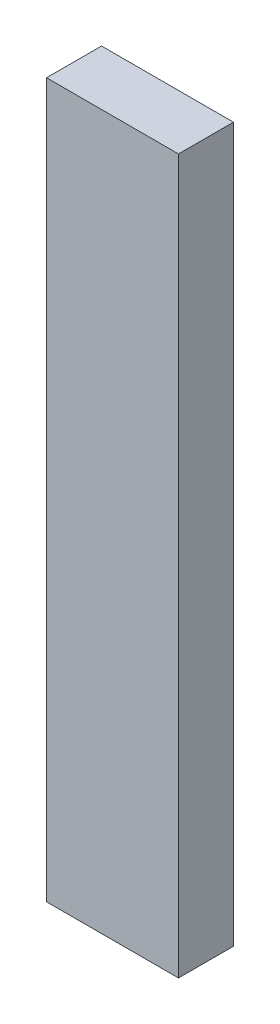
ISO-10303-21;
HEADER;
FILE_DESCRIPTION(('STEP AP214'),'2;1');
FILE_NAME('part.step','',(''),(''),'','','');
FILE_SCHEMA(('AUTOMOTIVE_DESIGN { 1 0 10303 214 1 1 1 1 }'));
ENDSEC;
DATA;
#1=APPLICATION_CONTEXT('core data for automotive mechanical design processes');
#2=APPLICATION_PROTOCOL_DEFINITION('international standard','automotive_design',2000,#1);
#3=PRODUCT_CONTEXT('',#1,'mechanical');
#4=PRODUCT('Part','Part','',(#3));
#5=PRODUCT_RELATED_PRODUCT_CATEGORY('part','',(#4));
#6=PRODUCT_DEFINITION_FORMATION('','',#4);
#7=PRODUCT_DEFINITION_CONTEXT('part definition',#1,'design');
#8=PRODUCT_DEFINITION('design','',#6,#7);
#9=PRODUCT_DEFINITION_SHAPE('','',#8);
#10=(LENGTH_UNIT() NAMED_UNIT(*) SI_UNIT(.MILLI.,.METRE.));
#11=(NAMED_UNIT(*) PLANE_ANGLE_UNIT() SI_UNIT($,.RADIAN.));
#12=(NAMED_UNIT(*) SI_UNIT($,.STERADIAN.) SOLID_ANGLE_UNIT());
#13=UNCERTAINTY_MEASURE_WITH_UNIT(LENGTH_MEASURE(1.E-05),#10,'distance_accuracy_value','');
#14=(GEOMETRIC_REPRESENTATION_CONTEXT(3) GLOBAL_UNCERTAINTY_ASSIGNED_CONTEXT((#13)) GLOBAL_UNIT_ASSIGNED_CONTEXT((#10,
#11,#12)) REPRESENTATION_CONTEXT('',''));
#15=CARTESIAN_POINT('',(0.,0.,0.));
#16=DIRECTION('',(0.,0.,1.));
#17=DIRECTION('',(1.,0.,0.));
#18=AXIS2_PLACEMENT_3D('',#15,#16,#17);
#19=CARTESIAN_POINT('',(-27.7297166911199,15.,0.));
#20=DIRECTION('',(-1.,0.,0.));
#21=DIRECTION('',(0.,0.,1.));
#22=AXIS2_PLACEMENT_3D('',#19,#20,#21);
#23=PLANE('',#22);
#24=DIRECTION('',(0.,0.,1.));
#25=VECTOR('',#24,1.);
#26=CARTESIAN_POINT('',(-27.7297166911199,-49.9016400553733,-75.3115837217811));
#27=LINE('',#26,#25);
#28=CARTESIAN_POINT('',(-27.7297166911199,-49.9016400553733,-75.3115837217811));
#29=VERTEX_POINT('',#28);
#30=CARTESIAN_POINT('',(-27.7297166911199,-49.9016400553734,-70.3115837217811));
#31=VERTEX_POINT('',#30);
#32=EDGE_CURVE('E49',#29,#31,#27,.T.);
#33=ORIENTED_EDGE('',*,*,#32,.F.);
#34=DIRECTION('',(0.,-1.,0.));
#35=VECTOR('',#34,1.);
#36=CARTESIAN_POINT('',(-27.7297166911199,15.,-75.3115837217811));
#37=LINE('',#36,#35);
#38=CARTESIAN_POINT('',(-27.7297166911199,15.,-75.3115837217811));
#39=VERTEX_POINT('',#38);
#40=EDGE_CURVE('E11',#39,#29,#37,.T.);
#41=ORIENTED_EDGE('',*,*,#40,.F.);
#42=DIRECTION('',(0.,0.,-1.));
#43=VECTOR('',#42,1.);
#44=CARTESIAN_POINT('',(-27.7297166911199,15.,0.));
#45=LINE('',#44,#43);
#46=CARTESIAN_POINT('',(-27.7297166911199,15.,-70.3115837217811));
#47=VERTEX_POINT('',#46);
#48=EDGE_CURVE('E101',#47,#39,#45,.T.);
#49=ORIENTED_EDGE('',*,*,#48,.F.);
#50=DIRECTION('',(0.,-1.,0.));
#51=VECTOR('',#50,1.);
#52=CARTESIAN_POINT('',(-27.7297166911199,15.,-70.3115837217811));
#53=LINE('',#52,#51);
#54=EDGE_CURVE('E92',#47,#31,#53,.T.);
#55=ORIENTED_EDGE('',*,*,#54,.T.);
#56=EDGE_LOOP('',(#33,#41,#49,#55));
#57=FACE_BOUND('',#56,.T.);
#58=ADVANCED_FACE('F35',(#57),#23,.F.);
#59=CARTESIAN_POINT('',(0.,15.,-75.3115837217811));
#60=DIRECTION('',(0.,0.,1.));
#61=DIRECTION('',(1.,0.,0.));
#62=AXIS2_PLACEMENT_3D('',#59,#60,#61);
#63=PLANE('',#62);
#64=DIRECTION('',(1.,0.,0.));
#65=VECTOR('',#64,1.);
#66=CARTESIAN_POINT('',(-27.7297166911199,-49.9016400553733,-75.3115837217811));
#67=LINE('',#66,#65);
#68=CARTESIAN_POINT('',(-39.7297166911199,-49.9016400553733,-75.3115837217811));
#69=VERTEX_POINT('',#68);
#70=EDGE_CURVE('E89',#69,#29,#67,.T.);
#71=ORIENTED_EDGE('',*,*,#70,.F.);
#72=DIRECTION('',(0.,-1.,0.));
#73=VECTOR('',#72,1.);
#74=CARTESIAN_POINT('',(-39.7297166911199,15.,-75.3115837217811));
#75=LINE('',#74,#73);
#76=CARTESIAN_POINT('',(-39.7297166911199,15.,-75.3115837217811));
#77=VERTEX_POINT('',#76);
#78=EDGE_CURVE('E42',#77,#69,#75,.T.);
#79=ORIENTED_EDGE('',*,*,#78,.F.);
#80=DIRECTION('',(-1.,0.,0.));
#81=VECTOR('',#80,1.);
#82=CARTESIAN_POINT('',(0.,15.,-75.3115837217811));
#83=LINE('',#82,#81);
#84=EDGE_CURVE('E99',#39,#77,#83,.T.);
#85=ORIENTED_EDGE('',*,*,#84,.F.);
#86=ORIENTED_EDGE('',*,*,#40,.T.);
#87=EDGE_LOOP('',(#71,#79,#85,#86));
#88=FACE_BOUND('',#87,.T.);
#89=ADVANCED_FACE('F108',(#88),#63,.F.);
#90=CARTESIAN_POINT('',(-39.7297166911199,15.,0.));
#91=DIRECTION('',(1.,0.,0.));
#92=DIRECTION('',(0.,0.,-1.));
#93=AXIS2_PLACEMENT_3D('',#90,#91,#92);
#94=PLANE('',#93);
#95=DIRECTION('',(0.,0.,-1.));
#96=VECTOR('',#95,1.);
#97=CARTESIAN_POINT('',(-39.7297166911199,-49.9016400553733,-75.3115837217811));
#98=LINE('',#97,#96);
#99=CARTESIAN_POINT('',(-39.7297166911199,-49.9016400553733,-70.3115837217811));
#100=VERTEX_POINT('',#99);
#101=EDGE_CURVE('E76',#100,#69,#98,.T.);
#102=ORIENTED_EDGE('',*,*,#101,.F.);
#103=DIRECTION('',(0.,-1.,0.));
#104=VECTOR('',#103,1.);
#105=CARTESIAN_POINT('',(-39.7297166911199,15.,-70.3115837217811));
#106=LINE('',#105,#104);
#107=CARTESIAN_POINT('',(-39.7297166911199,15.,-70.3115837217811));
#108=VERTEX_POINT('',#107);
#109=EDGE_CURVE('E87',#108,#100,#106,.T.);
#110=ORIENTED_EDGE('',*,*,#109,.F.);
#111=DIRECTION('',(0.,0.,1.));
#112=VECTOR('',#111,1.);
#113=CARTESIAN_POINT('',(-39.7297166911199,15.,0.));
#114=LINE('',#113,#112);
#115=EDGE_CURVE('E97',#77,#108,#114,.T.);
#116=ORIENTED_EDGE('',*,*,#115,.F.);
#117=ORIENTED_EDGE('',*,*,#78,.T.);
#118=EDGE_LOOP('',(#102,#110,#116,#117));
#119=FACE_BOUND('',#118,.T.);
#120=ADVANCED_FACE('F85',(#119),#94,.F.);
#121=CARTESIAN_POINT('',(0.,15.,-70.3115837217811));
#122=DIRECTION('',(0.,0.,-1.));
#123=DIRECTION('',(-1.,0.,0.));
#124=AXIS2_PLACEMENT_3D('',#121,#122,#123);
#125=PLANE('',#124);
#126=DIRECTION('',(-1.,0.,0.));
#127=VECTOR('',#126,1.);
#128=CARTESIAN_POINT('',(-27.7297166911199,-49.9016400553733,-70.3115837217811));
#129=LINE('',#128,#127);
#130=EDGE_CURVE('E73',#31,#100,#129,.T.);
#131=ORIENTED_EDGE('',*,*,#130,.F.);
#132=ORIENTED_EDGE('',*,*,#54,.F.);
#133=DIRECTION('',(1.,0.,0.));
#134=VECTOR('',#133,1.);
#135=CARTESIAN_POINT('',(0.,15.,-70.3115837217811));
#136=LINE('',#135,#134);
#137=EDGE_CURVE('E57',#108,#47,#136,.T.);
#138=ORIENTED_EDGE('',*,*,#137,.F.);
#139=ORIENTED_EDGE('',*,*,#109,.T.);
#140=EDGE_LOOP('',(#131,#132,#138,#139));
#141=FACE_BOUND('',#140,.T.);
#142=ADVANCED_FACE('F91',(#141),#125,.F.);
#143=CARTESIAN_POINT('',(0.,15.,0.));
#144=DIRECTION('',(0.,1.,0.));
#145=DIRECTION('',(0.,0.,1.));
#146=AXIS2_PLACEMENT_3D('',#143,#144,#145);
#147=PLANE('',#146);
#148=ORIENTED_EDGE('',*,*,#48,.T.);
#149=ORIENTED_EDGE('',*,*,#84,.T.);
#150=ORIENTED_EDGE('',*,*,#115,.T.);
#151=ORIENTED_EDGE('',*,*,#137,.T.);
#152=EDGE_LOOP('',(#148,#149,#150,#151));
#153=FACE_BOUND('',#152,.T.);
#154=ADVANCED_FACE('F109',(#153),#147,.T.);
#155=CARTESIAN_POINT('',(0.,-49.9016400553733,0.));
#156=DIRECTION('',(0.,-1.,0.));
#157=DIRECTION('',(0.,0.,-1.));
#158=AXIS2_PLACEMENT_3D('',#155,#156,#157);
#159=PLANE('',#158);
#160=ORIENTED_EDGE('',*,*,#32,.T.);
#161=ORIENTED_EDGE('',*,*,#130,.T.);
#162=ORIENTED_EDGE('',*,*,#101,.T.);
#163=ORIENTED_EDGE('',*,*,#70,.T.);
#164=EDGE_LOOP('',(#160,#161,#162,#163));
#165=FACE_BOUND('',#164,.T.);
#166=ADVANCED_FACE('F75',(#165),#159,.T.);
#167=CLOSED_SHELL('',(#58,#89,#120,#142,#154,#166));
#168=MANIFOLD_SOLID_BREP('B2',#167);
#169=ADVANCED_BREP_SHAPE_REPRESENTATION('',(#18,#168),#14);
#170=SHAPE_DEFINITION_REPRESENTATION(#9,#169);
ENDSEC;
END-ISO-10303-21;
